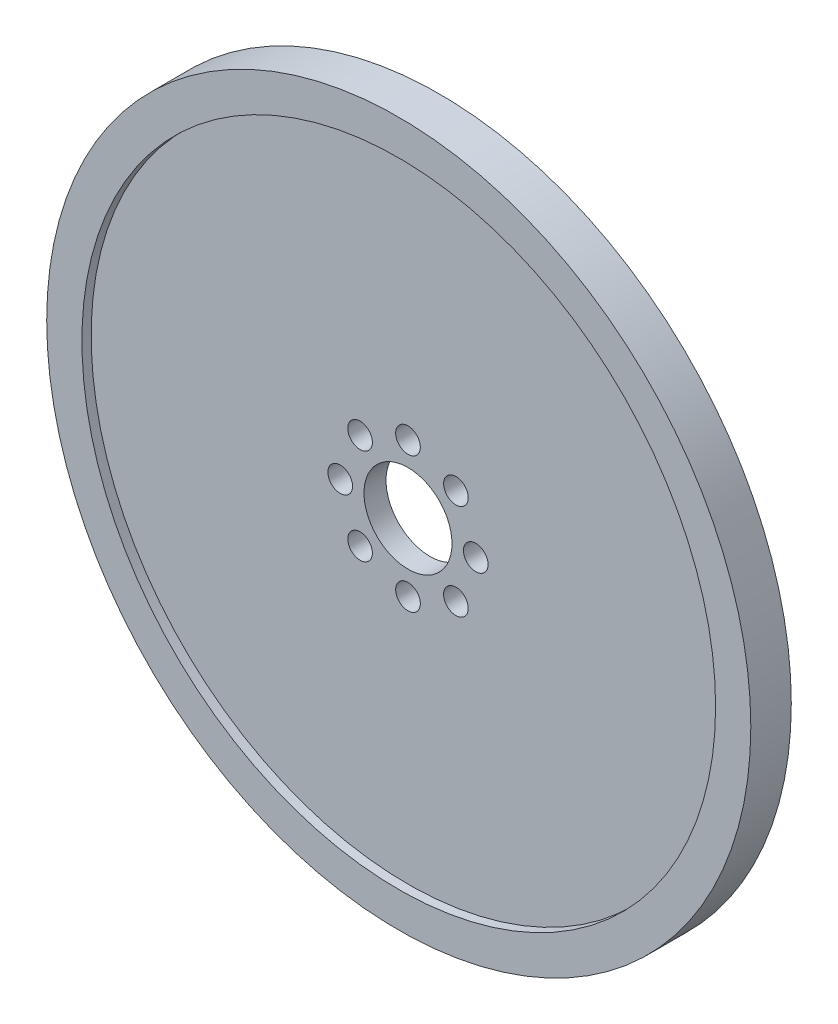
ISO-10303-21;
HEADER;
FILE_DESCRIPTION(('STEP AP214'),'2;1');
FILE_NAME('part.step','',(''),(''),'','','');
FILE_SCHEMA(('AUTOMOTIVE_DESIGN { 1 0 10303 214 1 1 1 1 }'));
ENDSEC;
DATA;
#1=APPLICATION_CONTEXT('core data for automotive mechanical design processes');
#2=APPLICATION_PROTOCOL_DEFINITION('international standard','automotive_design',2000,#1);
#3=PRODUCT_CONTEXT('',#1,'mechanical');
#4=PRODUCT('Part','Part','',(#3));
#5=PRODUCT_RELATED_PRODUCT_CATEGORY('part','',(#4));
#6=PRODUCT_DEFINITION_FORMATION('','',#4);
#7=PRODUCT_DEFINITION_CONTEXT('part definition',#1,'design');
#8=PRODUCT_DEFINITION('design','',#6,#7);
#9=PRODUCT_DEFINITION_SHAPE('','',#8);
#10=(LENGTH_UNIT() NAMED_UNIT(*) SI_UNIT(.MILLI.,.METRE.));
#11=(NAMED_UNIT(*) PLANE_ANGLE_UNIT() SI_UNIT($,.RADIAN.));
#12=(NAMED_UNIT(*) SI_UNIT($,.STERADIAN.) SOLID_ANGLE_UNIT());
#13=UNCERTAINTY_MEASURE_WITH_UNIT(LENGTH_MEASURE(1.E-05),#10,'distance_accuracy_value','');
#14=(GEOMETRIC_REPRESENTATION_CONTEXT(3) GLOBAL_UNCERTAINTY_ASSIGNED_CONTEXT((#13)) GLOBAL_UNIT_ASSIGNED_CONTEXT((#10,
#11,#12)) REPRESENTATION_CONTEXT('',''));
#15=CARTESIAN_POINT('',(0.,0.,0.));
#16=DIRECTION('',(0.,0.,1.));
#17=DIRECTION('',(1.,0.,0.));
#18=AXIS2_PLACEMENT_3D('',#15,#16,#17);
#19=CARTESIAN_POINT('',(0.,0.,2.921));
#20=DIRECTION('',(0.,0.,-1.));
#21=DIRECTION('',(-1.,0.,0.));
#22=AXIS2_PLACEMENT_3D('',#19,#20,#21);
#23=CYLINDRICAL_SURFACE('',#22,45.72);
#24=CARTESIAN_POINT('',(0.,0.,-2.921));
#25=DIRECTION('',(0.,0.,1.));
#26=DIRECTION('',(1.,0.,0.));
#27=AXIS2_PLACEMENT_3D('',#24,#25,#26);
#28=CIRCLE('',#27,45.72);
#29=CARTESIAN_POINT('',(45.72,0.,-2.921));
#30=VERTEX_POINT('',#29);
#31=EDGE_CURVE('E48',#30,#30,#28,.T.);
#32=ORIENTED_EDGE('',*,*,#31,.F.);
#33=EDGE_LOOP('',(#32));
#34=FACE_BOUND('',#33,.T.);
#35=CARTESIAN_POINT('',(0.,0.,-1.5875));
#36=DIRECTION('',(0.,0.,1.));
#37=DIRECTION('',(1.,0.,0.));
#38=AXIS2_PLACEMENT_3D('',#35,#36,#37);
#39=CIRCLE('',#38,45.72);
#40=CARTESIAN_POINT('',(45.72,0.,-1.5875));
#41=VERTEX_POINT('',#40);
#42=EDGE_CURVE('E51',#41,#41,#39,.T.);
#43=ORIENTED_EDGE('',*,*,#42,.T.);
#44=EDGE_LOOP('',(#43));
#45=FACE_BOUND('',#44,.T.);
#46=ADVANCED_FACE('F30',(#34,#45),#23,.F.);
#47=CARTESIAN_POINT('',(0.,0.,2.921));
#48=DIRECTION('',(0.,0.,1.));
#49=DIRECTION('',(1.,0.,0.));
#50=AXIS2_PLACEMENT_3D('',#47,#48,#49);
#51=PLANE('',#50);
#52=CARTESIAN_POINT('',(0.,0.,2.921));
#53=DIRECTION('',(0.,0.,1.));
#54=DIRECTION('',(1.,0.,0.));
#55=AXIS2_PLACEMENT_3D('',#52,#53,#54);
#56=CIRCLE('',#55,50.8);
#57=CARTESIAN_POINT('',(50.8,0.,2.921));
#58=VERTEX_POINT('',#57);
#59=EDGE_CURVE('E37',#58,#58,#56,.T.);
#60=ORIENTED_EDGE('',*,*,#59,.T.);
#61=EDGE_LOOP('',(#60));
#62=FACE_BOUND('',#61,.T.);
#63=CARTESIAN_POINT('',(0.,0.,2.921));
#64=DIRECTION('',(0.,0.,1.));
#65=DIRECTION('',(1.,0.,0.));
#66=AXIS2_PLACEMENT_3D('',#63,#64,#65);
#67=CIRCLE('',#66,45.72);
#68=CARTESIAN_POINT('',(45.72,0.,2.921));
#69=VERTEX_POINT('',#68);
#70=EDGE_CURVE('E46',#69,#69,#67,.T.);
#71=ORIENTED_EDGE('',*,*,#70,.F.);
#72=EDGE_LOOP('',(#71));
#73=FACE_BOUND('',#72,.T.);
#74=ADVANCED_FACE('F133',(#62,#73),#51,.T.);
#75=CARTESIAN_POINT('',(0.,0.,-2.921));
#76=DIRECTION('',(0.,0.,1.));
#77=DIRECTION('',(1.,0.,0.));
#78=AXIS2_PLACEMENT_3D('',#75,#76,#77);
#79=PLANE('',#78);
#80=CARTESIAN_POINT('',(0.,0.,-2.921));
#81=DIRECTION('',(0.,0.,1.));
#82=DIRECTION('',(1.,0.,0.));
#83=AXIS2_PLACEMENT_3D('',#80,#81,#82);
#84=CIRCLE('',#83,50.8);
#85=CARTESIAN_POINT('',(50.8,0.,-2.921));
#86=VERTEX_POINT('',#85);
#87=EDGE_CURVE('E41',#86,#86,#84,.T.);
#88=ORIENTED_EDGE('',*,*,#87,.F.);
#89=EDGE_LOOP('',(#88));
#90=FACE_BOUND('',#89,.T.);
#91=ORIENTED_EDGE('',*,*,#31,.T.);
#92=EDGE_LOOP('',(#91));
#93=FACE_BOUND('',#92,.T.);
#94=ADVANCED_FACE('F138',(#90,#93),#79,.F.);
#95=CARTESIAN_POINT('',(0.,0.,2.921));
#96=DIRECTION('',(0.,0.,-1.));
#97=DIRECTION('',(-1.,0.,0.));
#98=AXIS2_PLACEMENT_3D('',#95,#96,#97);
#99=CYLINDRICAL_SURFACE('',#98,50.8);
#100=ORIENTED_EDGE('',*,*,#59,.F.);
#101=EDGE_LOOP('',(#100));
#102=FACE_BOUND('',#101,.T.);
#103=ORIENTED_EDGE('',*,*,#87,.T.);
#104=EDGE_LOOP('',(#103));
#105=FACE_BOUND('',#104,.T.);
#106=ADVANCED_FACE('F32',(#102,#105),#99,.T.);
#107=CARTESIAN_POINT('',(0.,0.,1.5875));
#108=DIRECTION('',(0.,0.,1.));
#109=DIRECTION('',(1.,0.,0.));
#110=AXIS2_PLACEMENT_3D('',#107,#108,#109);
#111=CIRCLE('',#110,45.72);
#112=CARTESIAN_POINT('',(45.72,0.,1.5875));
#113=VERTEX_POINT('',#112);
#114=EDGE_CURVE('E10',#113,#113,#111,.T.);
#115=ORIENTED_EDGE('',*,*,#114,.F.);
#116=EDGE_LOOP('',(#115));
#117=FACE_BOUND('',#116,.T.);
#118=ORIENTED_EDGE('',*,*,#70,.T.);
#119=EDGE_LOOP('',(#118));
#120=FACE_BOUND('',#119,.T.);
#121=ADVANCED_FACE('F117',(#117,#120),#23,.F.);
#122=CARTESIAN_POINT('',(0.,0.,1.5875));
#123=DIRECTION('',(0.,0.,1.));
#124=DIRECTION('',(1.,0.,0.));
#125=AXIS2_PLACEMENT_3D('',#122,#123,#124);
#126=PLANE('',#125);
#127=CARTESIAN_POINT('',(-9.779,1.02429588037641E-13,1.5875));
#128=DIRECTION('',(0.,0.,1.));
#129=DIRECTION('',(1.,0.,0.));
#130=AXIS2_PLACEMENT_3D('',#127,#128,#129);
#131=CIRCLE('',#130,1.778);
#132=CARTESIAN_POINT('',(-8.001,1.02429588037641E-13,1.5875));
#133=VERTEX_POINT('',#132);
#134=EDGE_CURVE('E96',#133,#133,#131,.T.);
#135=ORIENTED_EDGE('',*,*,#134,.F.);
#136=EDGE_LOOP('',(#135));
#137=FACE_BOUND('',#136,.T.);
#138=CARTESIAN_POINT('',(0.,-9.779,1.5875));
#139=DIRECTION('',(0.,0.,1.));
#140=DIRECTION('',(1.,0.,0.));
#141=AXIS2_PLACEMENT_3D('',#138,#139,#140);
#142=CIRCLE('',#141,1.778);
#143=CARTESIAN_POINT('',(1.77799999999993,-9.779,1.5875));
#144=VERTEX_POINT('',#143);
#145=EDGE_CURVE('E84',#144,#144,#142,.T.);
#146=ORIENTED_EDGE('',*,*,#145,.F.);
#147=EDGE_LOOP('',(#146));
#148=FACE_BOUND('',#147,.T.);
#149=CARTESIAN_POINT('',(9.779,0.,1.5875));
#150=DIRECTION('',(0.,0.,1.));
#151=DIRECTION('',(1.,0.,0.));
#152=AXIS2_PLACEMENT_3D('',#149,#150,#151);
#153=CIRCLE('',#152,1.778);
#154=CARTESIAN_POINT('',(11.557,0.,1.5875));
#155=VERTEX_POINT('',#154);
#156=EDGE_CURVE('E72',#155,#155,#153,.T.);
#157=ORIENTED_EDGE('',*,*,#156,.F.);
#158=EDGE_LOOP('',(#157));
#159=FACE_BOUND('',#158,.T.);
#160=CARTESIAN_POINT('',(0.,9.779,1.5875));
#161=DIRECTION('',(0.,0.,1.));
#162=DIRECTION('',(1.,0.,0.));
#163=AXIS2_PLACEMENT_3D('',#160,#161,#162);
#164=CIRCLE('',#163,1.778);
#165=CARTESIAN_POINT('',(1.778,9.779,1.5875));
#166=VERTEX_POINT('',#165);
#167=EDGE_CURVE('E60',#166,#166,#164,.T.);
#168=ORIENTED_EDGE('',*,*,#167,.F.);
#169=EDGE_LOOP('',(#168));
#170=FACE_BOUND('',#169,.T.);
#171=ORIENTED_EDGE('',*,*,#114,.T.);
#172=EDGE_LOOP('',(#171));
#173=FACE_BOUND('',#172,.T.);
#174=CARTESIAN_POINT('',(0.,0.,1.5875));
#175=DIRECTION('',(0.,0.,1.));
#176=DIRECTION('',(1.,0.,0.));
#177=AXIS2_PLACEMENT_3D('',#174,#175,#176);
#178=CIRCLE('',#177,6.35);
#179=CARTESIAN_POINT('',(6.35,0.,1.5875));
#180=VERTEX_POINT('',#179);
#181=EDGE_CURVE('E56',#180,#180,#178,.T.);
#182=ORIENTED_EDGE('',*,*,#181,.F.);
#183=EDGE_LOOP('',(#182));
#184=FACE_BOUND('',#183,.T.);
#185=CARTESIAN_POINT('',(6.91479721322326,6.91479721322324,1.5875));
#186=DIRECTION('',(0.,0.,1.));
#187=DIRECTION('',(1.,0.,0.));
#188=AXIS2_PLACEMENT_3D('',#185,#186,#187);
#189=CIRCLE('',#188,1.778);
#190=CARTESIAN_POINT('',(8.69279721322326,6.91479721322324,1.5875));
#191=VERTEX_POINT('',#190);
#192=EDGE_CURVE('E66',#191,#191,#189,.T.);
#193=ORIENTED_EDGE('',*,*,#192,.F.);
#194=EDGE_LOOP('',(#193));
#195=FACE_BOUND('',#194,.T.);
#196=CARTESIAN_POINT('',(6.91479721322321,-6.91479721322328,1.5875));
#197=DIRECTION('',(0.,0.,1.));
#198=DIRECTION('',(1.,0.,0.));
#199=AXIS2_PLACEMENT_3D('',#196,#197,#198);
#200=CIRCLE('',#199,1.778);
#201=CARTESIAN_POINT('',(8.69279721322321,-6.91479721322328,1.5875));
#202=VERTEX_POINT('',#201);
#203=EDGE_CURVE('E78',#202,#202,#200,.T.);
#204=ORIENTED_EDGE('',*,*,#203,.F.);
#205=EDGE_LOOP('',(#204));
#206=FACE_BOUND('',#205,.T.);
#207=CARTESIAN_POINT('',(-6.91479721322331,-6.91479721322319,1.5875));
#208=DIRECTION('',(0.,0.,1.));
#209=DIRECTION('',(1.,0.,0.));
#210=AXIS2_PLACEMENT_3D('',#207,#208,#209);
#211=CIRCLE('',#210,1.778);
#212=CARTESIAN_POINT('',(-5.13679721322331,-6.91479721322319,1.5875));
#213=VERTEX_POINT('',#212);
#214=EDGE_CURVE('E90',#213,#213,#211,.T.);
#215=ORIENTED_EDGE('',*,*,#214,.F.);
#216=EDGE_LOOP('',(#215));
#217=FACE_BOUND('',#216,.T.);
#218=CARTESIAN_POINT('',(-6.91479721322316,6.91479721322333,1.5875));
#219=DIRECTION('',(0.,0.,1.));
#220=DIRECTION('',(1.,0.,0.));
#221=AXIS2_PLACEMENT_3D('',#218,#219,#220);
#222=CIRCLE('',#221,1.778);
#223=CARTESIAN_POINT('',(-5.13679721322316,6.91479721322333,1.5875));
#224=VERTEX_POINT('',#223);
#225=EDGE_CURVE('E102',#224,#224,#222,.T.);
#226=ORIENTED_EDGE('',*,*,#225,.F.);
#227=EDGE_LOOP('',(#226));
#228=FACE_BOUND('',#227,.T.);
#229=ADVANCED_FACE('F114',(#137,#148,#159,#170,#173,#184,#195,#206,#217,#228),#126,.T.);
#230=CARTESIAN_POINT('',(0.,0.,-1.5875));
#231=DIRECTION('',(0.,0.,1.));
#232=DIRECTION('',(1.,0.,0.));
#233=AXIS2_PLACEMENT_3D('',#230,#231,#232);
#234=PLANE('',#233);
#235=CARTESIAN_POINT('',(-9.779,1.02429588037641E-13,-1.5875));
#236=DIRECTION('',(0.,0.,1.));
#237=DIRECTION('',(1.,0.,0.));
#238=AXIS2_PLACEMENT_3D('',#235,#236,#237);
#239=CIRCLE('',#238,1.778);
#240=CARTESIAN_POINT('',(-8.001,1.02429588037641E-13,-1.5875));
#241=VERTEX_POINT('',#240);
#242=EDGE_CURVE('E99',#241,#241,#239,.T.);
#243=ORIENTED_EDGE('',*,*,#242,.T.);
#244=EDGE_LOOP('',(#243));
#245=FACE_BOUND('',#244,.T.);
#246=CARTESIAN_POINT('',(0.,-9.779,-1.5875));
#247=DIRECTION('',(0.,0.,1.));
#248=DIRECTION('',(1.,0.,0.));
#249=AXIS2_PLACEMENT_3D('',#246,#247,#248);
#250=CIRCLE('',#249,1.778);
#251=CARTESIAN_POINT('',(1.77799999999993,-9.779,-1.5875));
#252=VERTEX_POINT('',#251);
#253=EDGE_CURVE('E87',#252,#252,#250,.T.);
#254=ORIENTED_EDGE('',*,*,#253,.T.);
#255=EDGE_LOOP('',(#254));
#256=FACE_BOUND('',#255,.T.);
#257=CARTESIAN_POINT('',(9.779,0.,-1.5875));
#258=DIRECTION('',(0.,0.,1.));
#259=DIRECTION('',(1.,0.,0.));
#260=AXIS2_PLACEMENT_3D('',#257,#258,#259);
#261=CIRCLE('',#260,1.778);
#262=CARTESIAN_POINT('',(11.557,0.,-1.5875));
#263=VERTEX_POINT('',#262);
#264=EDGE_CURVE('E75',#263,#263,#261,.T.);
#265=ORIENTED_EDGE('',*,*,#264,.T.);
#266=EDGE_LOOP('',(#265));
#267=FACE_BOUND('',#266,.T.);
#268=CARTESIAN_POINT('',(0.,9.779,-1.5875));
#269=DIRECTION('',(0.,0.,1.));
#270=DIRECTION('',(1.,0.,0.));
#271=AXIS2_PLACEMENT_3D('',#268,#269,#270);
#272=CIRCLE('',#271,1.778);
#273=CARTESIAN_POINT('',(1.778,9.779,-1.5875));
#274=VERTEX_POINT('',#273);
#275=EDGE_CURVE('E63',#274,#274,#272,.T.);
#276=ORIENTED_EDGE('',*,*,#275,.T.);
#277=EDGE_LOOP('',(#276));
#278=FACE_BOUND('',#277,.T.);
#279=ORIENTED_EDGE('',*,*,#42,.F.);
#280=EDGE_LOOP('',(#279));
#281=FACE_BOUND('',#280,.T.);
#282=CARTESIAN_POINT('',(0.,0.,-1.5875));
#283=DIRECTION('',(0.,0.,1.));
#284=DIRECTION('',(1.,0.,0.));
#285=AXIS2_PLACEMENT_3D('',#282,#283,#284);
#286=CIRCLE('',#285,6.35);
#287=CARTESIAN_POINT('',(6.35,0.,-1.5875));
#288=VERTEX_POINT('',#287);
#289=EDGE_CURVE('E57',#288,#288,#286,.T.);
#290=ORIENTED_EDGE('',*,*,#289,.T.);
#291=EDGE_LOOP('',(#290));
#292=FACE_BOUND('',#291,.T.);
#293=CARTESIAN_POINT('',(6.91479721322326,6.91479721322324,-1.5875));
#294=DIRECTION('',(0.,0.,1.));
#295=DIRECTION('',(1.,0.,0.));
#296=AXIS2_PLACEMENT_3D('',#293,#294,#295);
#297=CIRCLE('',#296,1.778);
#298=CARTESIAN_POINT('',(8.69279721322326,6.91479721322324,-1.5875));
#299=VERTEX_POINT('',#298);
#300=EDGE_CURVE('E69',#299,#299,#297,.T.);
#301=ORIENTED_EDGE('',*,*,#300,.T.);
#302=EDGE_LOOP('',(#301));
#303=FACE_BOUND('',#302,.T.);
#304=CARTESIAN_POINT('',(6.91479721322321,-6.91479721322328,-1.5875));
#305=DIRECTION('',(0.,0.,1.));
#306=DIRECTION('',(1.,0.,0.));
#307=AXIS2_PLACEMENT_3D('',#304,#305,#306);
#308=CIRCLE('',#307,1.778);
#309=CARTESIAN_POINT('',(8.69279721322321,-6.91479721322328,-1.5875));
#310=VERTEX_POINT('',#309);
#311=EDGE_CURVE('E81',#310,#310,#308,.T.);
#312=ORIENTED_EDGE('',*,*,#311,.T.);
#313=EDGE_LOOP('',(#312));
#314=FACE_BOUND('',#313,.T.);
#315=CARTESIAN_POINT('',(-6.91479721322331,-6.91479721322319,-1.5875));
#316=DIRECTION('',(0.,0.,1.));
#317=DIRECTION('',(1.,0.,0.));
#318=AXIS2_PLACEMENT_3D('',#315,#316,#317);
#319=CIRCLE('',#318,1.778);
#320=CARTESIAN_POINT('',(-5.13679721322331,-6.91479721322319,-1.5875));
#321=VERTEX_POINT('',#320);
#322=EDGE_CURVE('E93',#321,#321,#319,.T.);
#323=ORIENTED_EDGE('',*,*,#322,.T.);
#324=EDGE_LOOP('',(#323));
#325=FACE_BOUND('',#324,.T.);
#326=CARTESIAN_POINT('',(-6.91479721322316,6.91479721322333,-1.5875));
#327=DIRECTION('',(0.,0.,1.));
#328=DIRECTION('',(1.,0.,0.));
#329=AXIS2_PLACEMENT_3D('',#326,#327,#328);
#330=CIRCLE('',#329,1.778);
#331=CARTESIAN_POINT('',(-5.13679721322316,6.91479721322333,-1.5875));
#332=VERTEX_POINT('',#331);
#333=EDGE_CURVE('E105',#332,#332,#330,.T.);
#334=ORIENTED_EDGE('',*,*,#333,.T.);
#335=EDGE_LOOP('',(#334));
#336=FACE_BOUND('',#335,.T.);
#337=ADVANCED_FACE('F116',(#245,#256,#267,#278,#281,#292,#303,#314,#325,#336),#234,.F.);
#338=CARTESIAN_POINT('',(0.,0.,1.5875));
#339=DIRECTION('',(0.,0.,-1.));
#340=DIRECTION('',(-1.,0.,0.));
#341=AXIS2_PLACEMENT_3D('',#338,#339,#340);
#342=CYLINDRICAL_SURFACE('',#341,6.35);
#343=ORIENTED_EDGE('',*,*,#181,.T.);
#344=EDGE_LOOP('',(#343));
#345=FACE_BOUND('',#344,.T.);
#346=ORIENTED_EDGE('',*,*,#289,.F.);
#347=EDGE_LOOP('',(#346));
#348=FACE_BOUND('',#347,.T.);
#349=ADVANCED_FACE('F124',(#345,#348),#342,.F.);
#350=CARTESIAN_POINT('',(0.,9.779,1.5875));
#351=DIRECTION('',(0.,0.,-1.));
#352=DIRECTION('',(-1.,0.,0.));
#353=AXIS2_PLACEMENT_3D('',#350,#351,#352);
#354=CYLINDRICAL_SURFACE('',#353,1.778);
#355=ORIENTED_EDGE('',*,*,#167,.T.);
#356=EDGE_LOOP('',(#355));
#357=FACE_BOUND('',#356,.T.);
#358=ORIENTED_EDGE('',*,*,#275,.F.);
#359=EDGE_LOOP('',(#358));
#360=FACE_BOUND('',#359,.T.);
#361=ADVANCED_FACE('F178',(#357,#360),#354,.F.);
#362=CARTESIAN_POINT('',(6.91479721322326,6.91479721322324,1.5875));
#363=DIRECTION('',(0.,0.,-1.));
#364=DIRECTION('',(-1.,0.,0.));
#365=AXIS2_PLACEMENT_3D('',#362,#363,#364);
#366=CYLINDRICAL_SURFACE('',#365,1.778);
#367=ORIENTED_EDGE('',*,*,#192,.T.);
#368=EDGE_LOOP('',(#367));
#369=FACE_BOUND('',#368,.T.);
#370=ORIENTED_EDGE('',*,*,#300,.F.);
#371=EDGE_LOOP('',(#370));
#372=FACE_BOUND('',#371,.T.);
#373=ADVANCED_FACE('F187',(#369,#372),#366,.F.);
#374=CARTESIAN_POINT('',(9.779,0.,1.5875));
#375=DIRECTION('',(0.,0.,-1.));
#376=DIRECTION('',(-1.,0.,0.));
#377=AXIS2_PLACEMENT_3D('',#374,#375,#376);
#378=CYLINDRICAL_SURFACE('',#377,1.778);
#379=ORIENTED_EDGE('',*,*,#156,.T.);
#380=EDGE_LOOP('',(#379));
#381=FACE_BOUND('',#380,.T.);
#382=ORIENTED_EDGE('',*,*,#264,.F.);
#383=EDGE_LOOP('',(#382));
#384=FACE_BOUND('',#383,.T.);
#385=ADVANCED_FACE('F197',(#381,#384),#378,.F.);
#386=CARTESIAN_POINT('',(6.91479721322321,-6.91479721322328,1.5875));
#387=DIRECTION('',(0.,0.,-1.));
#388=DIRECTION('',(-1.,0.,0.));
#389=AXIS2_PLACEMENT_3D('',#386,#387,#388);
#390=CYLINDRICAL_SURFACE('',#389,1.778);
#391=ORIENTED_EDGE('',*,*,#203,.T.);
#392=EDGE_LOOP('',(#391));
#393=FACE_BOUND('',#392,.T.);
#394=ORIENTED_EDGE('',*,*,#311,.F.);
#395=EDGE_LOOP('',(#394));
#396=FACE_BOUND('',#395,.T.);
#397=ADVANCED_FACE('F207',(#393,#396),#390,.F.);
#398=CARTESIAN_POINT('',(0.,-9.779,1.5875));
#399=DIRECTION('',(0.,0.,-1.));
#400=DIRECTION('',(-1.,0.,0.));
#401=AXIS2_PLACEMENT_3D('',#398,#399,#400);
#402=CYLINDRICAL_SURFACE('',#401,1.778);
#403=ORIENTED_EDGE('',*,*,#145,.T.);
#404=EDGE_LOOP('',(#403));
#405=FACE_BOUND('',#404,.T.);
#406=ORIENTED_EDGE('',*,*,#253,.F.);
#407=EDGE_LOOP('',(#406));
#408=FACE_BOUND('',#407,.T.);
#409=ADVANCED_FACE('F217',(#405,#408),#402,.F.);
#410=CARTESIAN_POINT('',(-6.91479721322331,-6.91479721322319,1.5875));
#411=DIRECTION('',(0.,0.,-1.));
#412=DIRECTION('',(-1.,0.,0.));
#413=AXIS2_PLACEMENT_3D('',#410,#411,#412);
#414=CYLINDRICAL_SURFACE('',#413,1.778);
#415=ORIENTED_EDGE('',*,*,#214,.T.);
#416=EDGE_LOOP('',(#415));
#417=FACE_BOUND('',#416,.T.);
#418=ORIENTED_EDGE('',*,*,#322,.F.);
#419=EDGE_LOOP('',(#418));
#420=FACE_BOUND('',#419,.T.);
#421=ADVANCED_FACE('F227',(#417,#420),#414,.F.);
#422=CARTESIAN_POINT('',(-9.779,1.02429588037641E-13,1.5875));
#423=DIRECTION('',(0.,0.,-1.));
#424=DIRECTION('',(-1.,0.,0.));
#425=AXIS2_PLACEMENT_3D('',#422,#423,#424);
#426=CYLINDRICAL_SURFACE('',#425,1.778);
#427=ORIENTED_EDGE('',*,*,#134,.T.);
#428=EDGE_LOOP('',(#427));
#429=FACE_BOUND('',#428,.T.);
#430=ORIENTED_EDGE('',*,*,#242,.F.);
#431=EDGE_LOOP('',(#430));
#432=FACE_BOUND('',#431,.T.);
#433=ADVANCED_FACE('F237',(#429,#432),#426,.F.);
#434=CARTESIAN_POINT('',(-6.91479721322316,6.91479721322333,1.5875));
#435=DIRECTION('',(0.,0.,-1.));
#436=DIRECTION('',(-1.,0.,0.));
#437=AXIS2_PLACEMENT_3D('',#434,#435,#436);
#438=CYLINDRICAL_SURFACE('',#437,1.778);
#439=ORIENTED_EDGE('',*,*,#225,.T.);
#440=EDGE_LOOP('',(#439));
#441=FACE_BOUND('',#440,.T.);
#442=ORIENTED_EDGE('',*,*,#333,.F.);
#443=EDGE_LOOP('',(#442));
#444=FACE_BOUND('',#443,.T.);
#445=ADVANCED_FACE('F111',(#441,#444),#438,.F.);
#446=CLOSED_SHELL('',(#46,#74,#94,#106,#121,#229,#337,#349,#361,#373,#385,#397,#409,#421,#433,#445));
#447=MANIFOLD_SOLID_BREP('B2',#446);
#448=ADVANCED_BREP_SHAPE_REPRESENTATION('',(#18,#447),#14);
#449=SHAPE_DEFINITION_REPRESENTATION(#9,#448);
ENDSEC;
END-ISO-10303-21;
